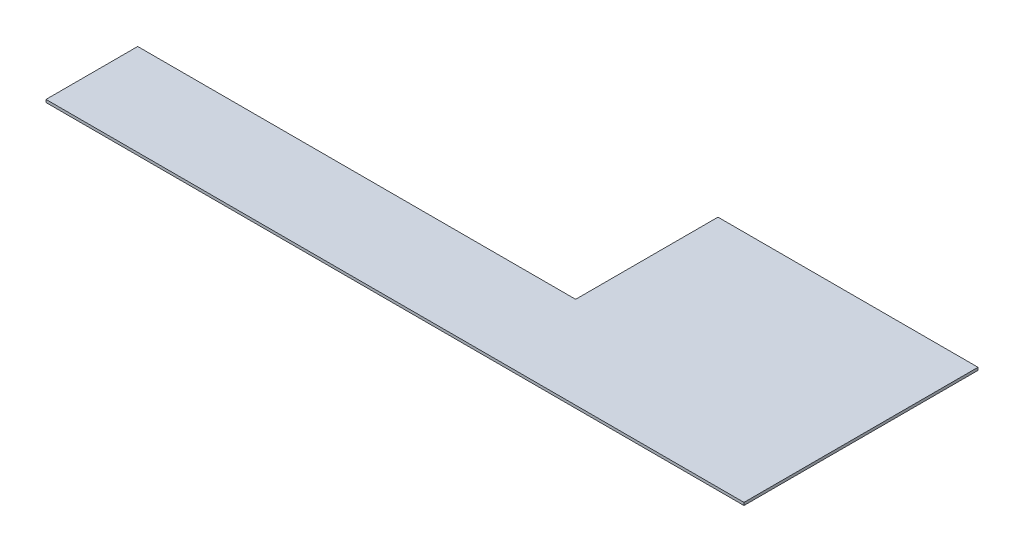
ISO-10303-21;
HEADER;
FILE_DESCRIPTION(('STEP AP214'),'2;1');
FILE_NAME('part.step','',(''),(''),'','','');
FILE_SCHEMA(('AUTOMOTIVE_DESIGN { 1 0 10303 214 1 1 1 1 }'));
ENDSEC;
DATA;
#1=APPLICATION_CONTEXT('core data for automotive mechanical design processes');
#2=APPLICATION_PROTOCOL_DEFINITION('international standard','automotive_design',2000,#1);
#3=PRODUCT_CONTEXT('',#1,'mechanical');
#4=PRODUCT('Part','Part','',(#3));
#5=PRODUCT_RELATED_PRODUCT_CATEGORY('part','',(#4));
#6=PRODUCT_DEFINITION_FORMATION('','',#4);
#7=PRODUCT_DEFINITION_CONTEXT('part definition',#1,'design');
#8=PRODUCT_DEFINITION('design','',#6,#7);
#9=PRODUCT_DEFINITION_SHAPE('','',#8);
#10=(LENGTH_UNIT() NAMED_UNIT(*) SI_UNIT(.MILLI.,.METRE.));
#11=(NAMED_UNIT(*) PLANE_ANGLE_UNIT() SI_UNIT($,.RADIAN.));
#12=(NAMED_UNIT(*) SI_UNIT($,.STERADIAN.) SOLID_ANGLE_UNIT());
#13=UNCERTAINTY_MEASURE_WITH_UNIT(LENGTH_MEASURE(1.E-05),#10,'distance_accuracy_value','');
#14=(GEOMETRIC_REPRESENTATION_CONTEXT(3) GLOBAL_UNCERTAINTY_ASSIGNED_CONTEXT((#13)) GLOBAL_UNIT_ASSIGNED_CONTEXT((#10,
#11,#12)) REPRESENTATION_CONTEXT('',''));
#15=CARTESIAN_POINT('',(0.,0.,0.));
#16=DIRECTION('',(0.,0.,1.));
#17=DIRECTION('',(1.,0.,0.));
#18=AXIS2_PLACEMENT_3D('',#15,#16,#17);
#19=CARTESIAN_POINT('',(603.25,6.35,212.725));
#20=DIRECTION('',(-1.,0.,0.));
#21=DIRECTION('',(0.,0.,1.));
#22=AXIS2_PLACEMENT_3D('',#19,#20,#21);
#23=PLANE('',#22);
#24=DIRECTION('',(0.,0.,-1.));
#25=VECTOR('',#24,1.);
#26=CARTESIAN_POINT('',(603.25,0.,212.725));
#27=LINE('',#26,#25);
#28=CARTESIAN_POINT('',(603.25,0.,212.725));
#29=VERTEX_POINT('',#28);
#30=CARTESIAN_POINT('',(603.25,0.,-330.2));
#31=VERTEX_POINT('',#30);
#32=EDGE_CURVE('E116',#29,#31,#27,.T.);
#33=ORIENTED_EDGE('',*,*,#32,.T.);
#34=DIRECTION('',(0.,-1.,0.));
#35=VECTOR('',#34,1.);
#36=CARTESIAN_POINT('',(603.25,6.35,-330.2));
#37=LINE('',#36,#35);
#38=CARTESIAN_POINT('',(603.25,6.35,-330.2));
#39=VERTEX_POINT('',#38);
#40=EDGE_CURVE('E11',#39,#31,#37,.T.);
#41=ORIENTED_EDGE('',*,*,#40,.F.);
#42=DIRECTION('',(0.,0.,-1.));
#43=VECTOR('',#42,1.);
#44=CARTESIAN_POINT('',(603.25,6.35,212.725));
#45=LINE('',#44,#43);
#46=CARTESIAN_POINT('',(603.25,6.35,212.725));
#47=VERTEX_POINT('',#46);
#48=EDGE_CURVE('E126',#47,#39,#45,.T.);
#49=ORIENTED_EDGE('',*,*,#48,.F.);
#50=DIRECTION('',(0.,-1.,0.));
#51=VECTOR('',#50,1.);
#52=CARTESIAN_POINT('',(603.25,6.35,212.725));
#53=LINE('',#52,#51);
#54=EDGE_CURVE('E112',#47,#29,#53,.T.);
#55=ORIENTED_EDGE('',*,*,#54,.T.);
#56=EDGE_LOOP('',(#33,#41,#49,#55));
#57=FACE_BOUND('',#56,.T.);
#58=ADVANCED_FACE('F32',(#57),#23,.F.);
#59=CARTESIAN_POINT('',(603.25,6.35,-330.2));
#60=DIRECTION('',(0.,0.,1.));
#61=DIRECTION('',(1.,0.,0.));
#62=AXIS2_PLACEMENT_3D('',#59,#60,#61);
#63=PLANE('',#62);
#64=DIRECTION('',(-1.,0.,0.));
#65=VECTOR('',#64,1.);
#66=CARTESIAN_POINT('',(603.25,0.,-330.2));
#67=LINE('',#66,#65);
#68=CARTESIAN_POINT('',(2.22044604925031E-13,0.,-330.2));
#69=VERTEX_POINT('',#68);
#70=EDGE_CURVE('E119',#31,#69,#67,.T.);
#71=ORIENTED_EDGE('',*,*,#70,.T.);
#72=DIRECTION('',(0.,-1.,0.));
#73=VECTOR('',#72,1.);
#74=CARTESIAN_POINT('',(2.22044604925031E-13,6.35,-330.2));
#75=LINE('',#74,#73);
#76=CARTESIAN_POINT('',(2.22044604925031E-13,6.35,-330.2));
#77=VERTEX_POINT('',#76);
#78=EDGE_CURVE('E40',#77,#69,#75,.T.);
#79=ORIENTED_EDGE('',*,*,#78,.F.);
#80=DIRECTION('',(-1.,0.,0.));
#81=VECTOR('',#80,1.);
#82=CARTESIAN_POINT('',(603.25,6.35,-330.2));
#83=LINE('',#82,#81);
#84=EDGE_CURVE('E85',#39,#77,#83,.T.);
#85=ORIENTED_EDGE('',*,*,#84,.F.);
#86=ORIENTED_EDGE('',*,*,#40,.T.);
#87=EDGE_LOOP('',(#71,#79,#85,#86));
#88=FACE_BOUND('',#87,.T.);
#89=ADVANCED_FACE('F150',(#88),#63,.F.);
#90=CARTESIAN_POINT('',(0.,6.35,1.11022302462516E-13));
#91=DIRECTION('',(1.,0.,0.));
#92=DIRECTION('',(0.,0.,-1.));
#93=AXIS2_PLACEMENT_3D('',#90,#91,#92);
#94=PLANE('',#93);
#95=DIRECTION('',(0.,0.,1.));
#96=VECTOR('',#95,1.);
#97=CARTESIAN_POINT('',(0.,0.,1.11022302462516E-13));
#98=LINE('',#97,#96);
#99=CARTESIAN_POINT('',(0.,0.,1.11022302462516E-13));
#100=VERTEX_POINT('',#99);
#101=EDGE_CURVE('E121',#69,#100,#98,.T.);
#102=ORIENTED_EDGE('',*,*,#101,.T.);
#103=DIRECTION('',(0.,-1.,0.));
#104=VECTOR('',#103,1.);
#105=CARTESIAN_POINT('',(0.,6.35,1.11022302462516E-13));
#106=LINE('',#105,#104);
#107=CARTESIAN_POINT('',(0.,6.35,1.11022302462516E-13));
#108=VERTEX_POINT('',#107);
#109=EDGE_CURVE('E107',#108,#100,#106,.T.);
#110=ORIENTED_EDGE('',*,*,#109,.F.);
#111=DIRECTION('',(0.,0.,1.));
#112=VECTOR('',#111,1.);
#113=CARTESIAN_POINT('',(0.,6.35,1.11022302462516E-13));
#114=LINE('',#113,#112);
#115=EDGE_CURVE('E98',#77,#108,#114,.T.);
#116=ORIENTED_EDGE('',*,*,#115,.F.);
#117=ORIENTED_EDGE('',*,*,#78,.T.);
#118=EDGE_LOOP('',(#102,#110,#116,#117));
#119=FACE_BOUND('',#118,.T.);
#120=ADVANCED_FACE('F132',(#119),#94,.F.);
#121=CARTESIAN_POINT('',(-1016.,6.35,0.));
#122=DIRECTION('',(0.,0.,1.));
#123=DIRECTION('',(1.,0.,0.));
#124=AXIS2_PLACEMENT_3D('',#121,#122,#123);
#125=PLANE('',#124);
#126=DIRECTION('',(-1.,0.,0.));
#127=VECTOR('',#126,1.);
#128=CARTESIAN_POINT('',(-1016.,0.,0.));
#129=LINE('',#128,#127);
#130=CARTESIAN_POINT('',(-1016.,0.,0.));
#131=VERTEX_POINT('',#130);
#132=EDGE_CURVE('E106',#100,#131,#129,.T.);
#133=ORIENTED_EDGE('',*,*,#132,.T.);
#134=DIRECTION('',(0.,-1.,0.));
#135=VECTOR('',#134,1.);
#136=CARTESIAN_POINT('',(-1016.,6.35,0.));
#137=LINE('',#136,#135);
#138=CARTESIAN_POINT('',(-1016.,6.35,0.));
#139=VERTEX_POINT('',#138);
#140=EDGE_CURVE('E103',#139,#131,#137,.T.);
#141=ORIENTED_EDGE('',*,*,#140,.F.);
#142=DIRECTION('',(-1.,0.,0.));
#143=VECTOR('',#142,1.);
#144=CARTESIAN_POINT('',(-1016.,6.35,0.));
#145=LINE('',#144,#143);
#146=EDGE_CURVE('E92',#108,#139,#145,.T.);
#147=ORIENTED_EDGE('',*,*,#146,.F.);
#148=ORIENTED_EDGE('',*,*,#109,.T.);
#149=EDGE_LOOP('',(#133,#141,#147,#148));
#150=FACE_BOUND('',#149,.T.);
#151=ADVANCED_FACE('F104',(#150),#125,.F.);
#152=CARTESIAN_POINT('',(-1016.,6.35,212.725));
#153=DIRECTION('',(1.,0.,0.));
#154=DIRECTION('',(0.,0.,-1.));
#155=AXIS2_PLACEMENT_3D('',#152,#153,#154);
#156=PLANE('',#155);
#157=DIRECTION('',(0.,0.,1.));
#158=VECTOR('',#157,1.);
#159=CARTESIAN_POINT('',(-1016.,0.,212.725));
#160=LINE('',#159,#158);
#161=CARTESIAN_POINT('',(-1016.,0.,212.725));
#162=VERTEX_POINT('',#161);
#163=EDGE_CURVE('E71',#131,#162,#160,.T.);
#164=ORIENTED_EDGE('',*,*,#163,.T.);
#165=DIRECTION('',(0.,-1.,0.));
#166=VECTOR('',#165,1.);
#167=CARTESIAN_POINT('',(-1016.,6.35,212.725));
#168=LINE('',#167,#166);
#169=CARTESIAN_POINT('',(-1016.,6.35,212.725));
#170=VERTEX_POINT('',#169);
#171=EDGE_CURVE('E108',#170,#162,#168,.T.);
#172=ORIENTED_EDGE('',*,*,#171,.F.);
#173=DIRECTION('',(0.,0.,1.));
#174=VECTOR('',#173,1.);
#175=CARTESIAN_POINT('',(-1016.,6.35,212.725));
#176=LINE('',#175,#174);
#177=EDGE_CURVE('E96',#139,#170,#176,.T.);
#178=ORIENTED_EDGE('',*,*,#177,.F.);
#179=ORIENTED_EDGE('',*,*,#140,.T.);
#180=EDGE_LOOP('',(#164,#172,#178,#179));
#181=FACE_BOUND('',#180,.T.);
#182=ADVANCED_FACE('F110',(#181),#156,.F.);
#183=CARTESIAN_POINT('',(603.25,6.35,212.725));
#184=DIRECTION('',(0.,0.,-1.));
#185=DIRECTION('',(-1.,0.,0.));
#186=AXIS2_PLACEMENT_3D('',#183,#184,#185);
#187=PLANE('',#186);
#188=DIRECTION('',(1.,0.,0.));
#189=VECTOR('',#188,1.);
#190=CARTESIAN_POINT('',(603.25,0.,212.725));
#191=LINE('',#190,#189);
#192=EDGE_CURVE('E77',#162,#29,#191,.T.);
#193=ORIENTED_EDGE('',*,*,#192,.T.);
#194=ORIENTED_EDGE('',*,*,#54,.F.);
#195=DIRECTION('',(1.,0.,0.));
#196=VECTOR('',#195,1.);
#197=CARTESIAN_POINT('',(603.25,6.35,212.725));
#198=LINE('',#197,#196);
#199=EDGE_CURVE('E48',#170,#47,#198,.T.);
#200=ORIENTED_EDGE('',*,*,#199,.F.);
#201=ORIENTED_EDGE('',*,*,#171,.T.);
#202=EDGE_LOOP('',(#193,#194,#200,#201));
#203=FACE_BOUND('',#202,.T.);
#204=ADVANCED_FACE('F139',(#203),#187,.F.);
#205=CARTESIAN_POINT('',(0.,6.35,0.));
#206=DIRECTION('',(0.,1.,0.));
#207=DIRECTION('',(0.,0.,1.));
#208=AXIS2_PLACEMENT_3D('',#205,#206,#207);
#209=PLANE('',#208);
#210=ORIENTED_EDGE('',*,*,#48,.T.);
#211=ORIENTED_EDGE('',*,*,#84,.T.);
#212=ORIENTED_EDGE('',*,*,#115,.T.);
#213=ORIENTED_EDGE('',*,*,#146,.T.);
#214=ORIENTED_EDGE('',*,*,#177,.T.);
#215=ORIENTED_EDGE('',*,*,#199,.T.);
#216=EDGE_LOOP('',(#210,#211,#212,#213,#214,#215));
#217=FACE_BOUND('',#216,.T.);
#218=ADVANCED_FACE('F94',(#217),#209,.T.);
#219=CARTESIAN_POINT('',(0.,0.,0.));
#220=DIRECTION('',(0.,1.,0.));
#221=DIRECTION('',(0.,0.,1.));
#222=AXIS2_PLACEMENT_3D('',#219,#220,#221);
#223=PLANE('',#222);
#224=ORIENTED_EDGE('',*,*,#32,.F.);
#225=ORIENTED_EDGE('',*,*,#192,.F.);
#226=ORIENTED_EDGE('',*,*,#163,.F.);
#227=ORIENTED_EDGE('',*,*,#132,.F.);
#228=ORIENTED_EDGE('',*,*,#101,.F.);
#229=ORIENTED_EDGE('',*,*,#70,.F.);
#230=EDGE_LOOP('',(#224,#225,#226,#227,#228,#229));
#231=FACE_BOUND('',#230,.T.);
#232=ADVANCED_FACE('F135',(#231),#223,.F.);
#233=CLOSED_SHELL('',(#58,#89,#120,#151,#182,#204,#218,#232));
#234=MANIFOLD_SOLID_BREP('B2',#233);
#235=ADVANCED_BREP_SHAPE_REPRESENTATION('',(#18,#234),#14);
#236=SHAPE_DEFINITION_REPRESENTATION(#9,#235);
ENDSEC;
END-ISO-10303-21;
